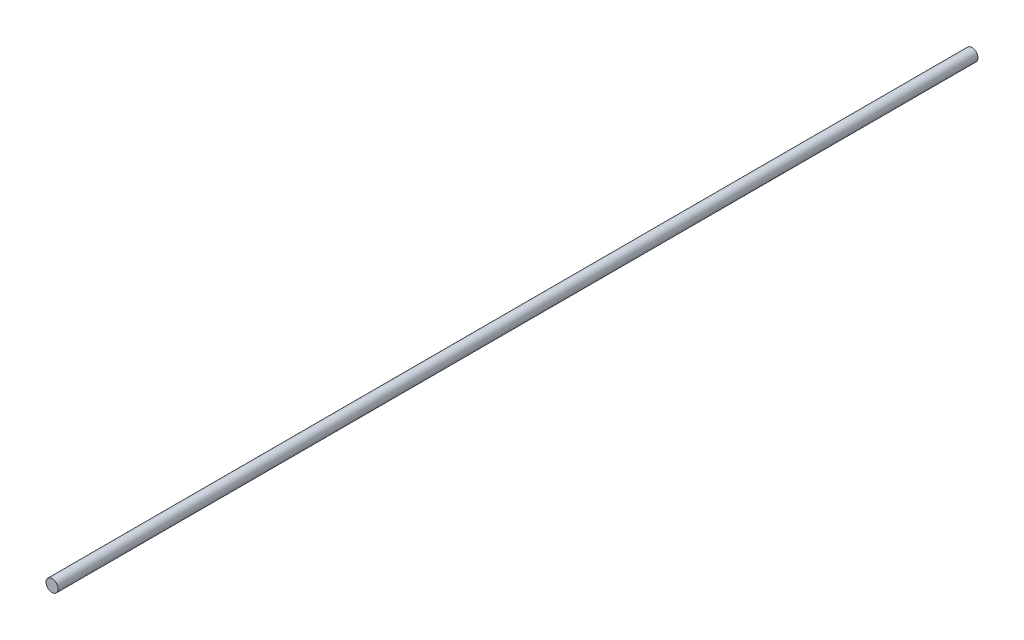
ISO-10303-21;
HEADER;
FILE_DESCRIPTION(('STEP AP214'),'2;1');
FILE_NAME('part.step','',(''),(''),'','','');
FILE_SCHEMA(('AUTOMOTIVE_DESIGN { 1 0 10303 214 1 1 1 1 }'));
ENDSEC;
DATA;
#1=APPLICATION_CONTEXT('core data for automotive mechanical design processes');
#2=APPLICATION_PROTOCOL_DEFINITION('international standard','automotive_design',2000,#1);
#3=PRODUCT_CONTEXT('',#1,'mechanical');
#4=PRODUCT('Part','Part','',(#3));
#5=PRODUCT_RELATED_PRODUCT_CATEGORY('part','',(#4));
#6=PRODUCT_DEFINITION_FORMATION('','',#4);
#7=PRODUCT_DEFINITION_CONTEXT('part definition',#1,'design');
#8=PRODUCT_DEFINITION('design','',#6,#7);
#9=PRODUCT_DEFINITION_SHAPE('','',#8);
#10=(LENGTH_UNIT() NAMED_UNIT(*) SI_UNIT(.MILLI.,.METRE.));
#11=(NAMED_UNIT(*) PLANE_ANGLE_UNIT() SI_UNIT($,.RADIAN.));
#12=(NAMED_UNIT(*) SI_UNIT($,.STERADIAN.) SOLID_ANGLE_UNIT());
#13=UNCERTAINTY_MEASURE_WITH_UNIT(LENGTH_MEASURE(1.E-05),#10,'distance_accuracy_value','');
#14=(GEOMETRIC_REPRESENTATION_CONTEXT(3) GLOBAL_UNCERTAINTY_ASSIGNED_CONTEXT((#13)) GLOBAL_UNIT_ASSIGNED_CONTEXT((#10,
#11,#12)) REPRESENTATION_CONTEXT('',''));
#15=CARTESIAN_POINT('',(0.,0.,0.));
#16=DIRECTION('',(0.,0.,1.));
#17=DIRECTION('',(1.,0.,0.));
#18=AXIS2_PLACEMENT_3D('',#15,#16,#17);
#19=CARTESIAN_POINT('',(-18.0817607368501,12.1069184528726,0.));
#20=DIRECTION('',(0.,0.,-1.));
#21=DIRECTION('',(-1.,0.,0.));
#22=AXIS2_PLACEMENT_3D('',#19,#20,#21);
#23=PLANE('',#22);
#24=CARTESIAN_POINT('',(-18.0817607368501,12.1069184528726,0.));
#25=DIRECTION('',(0.,0.,1.));
#26=DIRECTION('',(1.,0.,0.));
#27=AXIS2_PLACEMENT_3D('',#24,#25,#26);
#28=CIRCLE('',#27,3.175);
#29=CARTESIAN_POINT('',(-14.9067607368501,12.1069184528726,0.));
#30=VERTEX_POINT('',#29);
#31=EDGE_CURVE('E18',#30,#30,#28,.T.);
#32=ORIENTED_EDGE('',*,*,#31,.F.);
#33=EDGE_LOOP('',(#32));
#34=FACE_BOUND('',#33,.T.);
#35=ADVANCED_FACE('F15',(#34),#23,.T.);
#36=CARTESIAN_POINT('',(-18.0817607368501,12.1069184528726,482.6));
#37=DIRECTION('',(0.,0.,-1.));
#38=DIRECTION('',(-1.,0.,0.));
#39=AXIS2_PLACEMENT_3D('',#36,#37,#38);
#40=PLANE('',#39);
#41=CARTESIAN_POINT('',(-18.0817607368501,12.1069184528726,482.6));
#42=DIRECTION('',(0.,0.,1.));
#43=DIRECTION('',(1.,0.,0.));
#44=AXIS2_PLACEMENT_3D('',#41,#42,#43);
#45=CIRCLE('',#44,3.175);
#46=CARTESIAN_POINT('',(-14.9067607368501,12.1069184528726,482.6));
#47=VERTEX_POINT('',#46);
#48=EDGE_CURVE('E10',#47,#47,#45,.F.);
#49=ORIENTED_EDGE('',*,*,#48,.F.);
#50=EDGE_LOOP('',(#49));
#51=FACE_BOUND('',#50,.T.);
#52=ADVANCED_FACE('F30',(#51),#40,.F.);
#53=CARTESIAN_POINT('',(-18.0817607368501,12.1069184528726,0.));
#54=DIRECTION('',(0.,0.,1.));
#55=DIRECTION('',(1.,0.,0.));
#56=AXIS2_PLACEMENT_3D('',#53,#54,#55);
#57=CYLINDRICAL_SURFACE('',#56,3.175);
#58=ORIENTED_EDGE('',*,*,#48,.T.);
#59=EDGE_LOOP('',(#58));
#60=FACE_BOUND('',#59,.T.);
#61=ORIENTED_EDGE('',*,*,#31,.T.);
#62=EDGE_LOOP('',(#61));
#63=FACE_BOUND('',#62,.T.);
#64=ADVANCED_FACE('F27',(#60,#63),#57,.T.);
#65=CLOSED_SHELL('',(#35,#52,#64));
#66=MANIFOLD_SOLID_BREP('B1',#65);
#67=ADVANCED_BREP_SHAPE_REPRESENTATION('',(#18,#66),#14);
#68=SHAPE_DEFINITION_REPRESENTATION(#9,#67);
ENDSEC;
END-ISO-10303-21;
